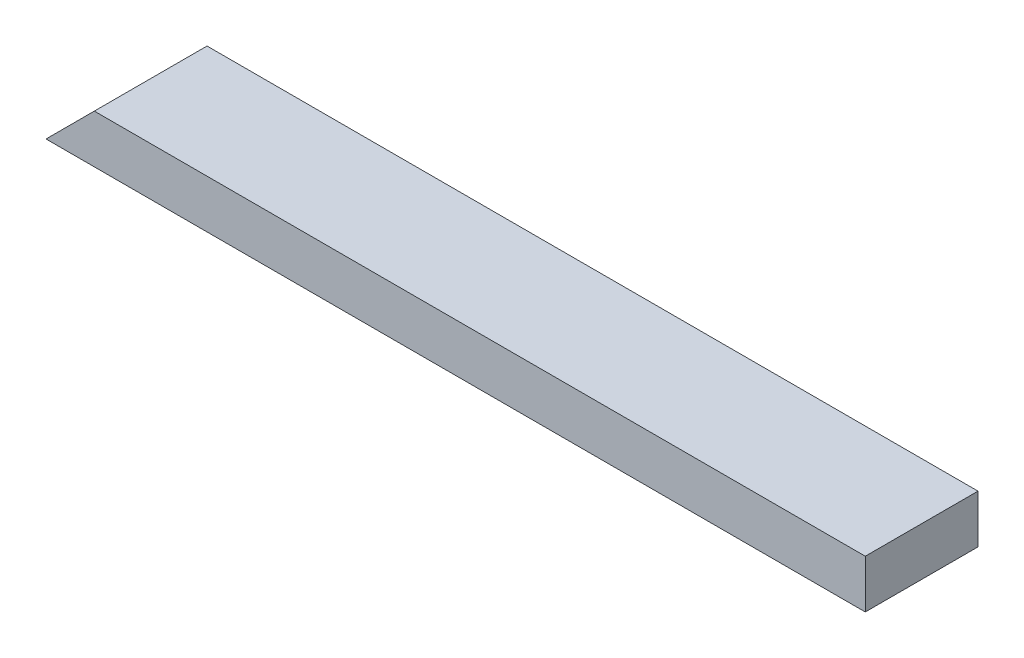
ISO-10303-21;
HEADER;
FILE_DESCRIPTION(('STEP AP214'),'2;1');
FILE_NAME('part.step','',(''),(''),'','','');
FILE_SCHEMA(('AUTOMOTIVE_DESIGN { 1 0 10303 214 1 1 1 1 }'));
ENDSEC;
DATA;
#1=APPLICATION_CONTEXT('core data for automotive mechanical design processes');
#2=APPLICATION_PROTOCOL_DEFINITION('international standard','automotive_design',2000,#1);
#3=PRODUCT_CONTEXT('',#1,'mechanical');
#4=PRODUCT('Part','Part','',(#3));
#5=PRODUCT_RELATED_PRODUCT_CATEGORY('part','',(#4));
#6=PRODUCT_DEFINITION_FORMATION('','',#4);
#7=PRODUCT_DEFINITION_CONTEXT('part definition',#1,'design');
#8=PRODUCT_DEFINITION('design','',#6,#7);
#9=PRODUCT_DEFINITION_SHAPE('','',#8);
#10=(LENGTH_UNIT() NAMED_UNIT(*) SI_UNIT(.MILLI.,.METRE.));
#11=(NAMED_UNIT(*) PLANE_ANGLE_UNIT() SI_UNIT($,.RADIAN.));
#12=(NAMED_UNIT(*) SI_UNIT($,.STERADIAN.) SOLID_ANGLE_UNIT());
#13=UNCERTAINTY_MEASURE_WITH_UNIT(LENGTH_MEASURE(1.E-05),#10,'distance_accuracy_value','');
#14=(GEOMETRIC_REPRESENTATION_CONTEXT(3) GLOBAL_UNCERTAINTY_ASSIGNED_CONTEXT((#13)) GLOBAL_UNIT_ASSIGNED_CONTEXT((#10,
#11,#12)) REPRESENTATION_CONTEXT('',''));
#15=CARTESIAN_POINT('',(0.,0.,0.));
#16=DIRECTION('',(0.,0.,1.));
#17=DIRECTION('',(1.,0.,0.));
#18=AXIS2_PLACEMENT_3D('',#15,#16,#17);
#19=CARTESIAN_POINT('',(0.,38.1,0.));
#20=DIRECTION('',(0.,0.,-1.));
#21=DIRECTION('',(-1.,0.,0.));
#22=AXIS2_PLACEMENT_3D('',#19,#20,#21);
#23=PLANE('',#22);
#24=DIRECTION('',(1.,0.,0.));
#25=VECTOR('',#24,1.);
#26=CARTESIAN_POINT('',(0.,38.1,0.));
#27=LINE('',#26,#25);
#28=CARTESIAN_POINT('',(38.1,38.1,0.));
#29=VERTEX_POINT('',#28);
#30=CARTESIAN_POINT('',(646.1125,38.1,0.));
#31=VERTEX_POINT('',#30);
#32=EDGE_CURVE('E97',#29,#31,#27,.T.);
#33=ORIENTED_EDGE('',*,*,#32,.F.);
#34=DIRECTION('',(0.707106781186547,0.707106781186547,0.));
#35=VECTOR('',#34,1.);
#36=CARTESIAN_POINT('',(0.,0.,0.));
#37=LINE('',#36,#35);
#38=CARTESIAN_POINT('',(0.,0.,0.));
#39=VERTEX_POINT('',#38);
#40=EDGE_CURVE('E90',#39,#29,#37,.T.);
#41=ORIENTED_EDGE('',*,*,#40,.F.);
#42=DIRECTION('',(1.,0.,0.));
#43=VECTOR('',#42,1.);
#44=CARTESIAN_POINT('',(0.,0.,0.));
#45=LINE('',#44,#43);
#46=CARTESIAN_POINT('',(646.1125,0.,0.));
#47=VERTEX_POINT('',#46);
#48=EDGE_CURVE('E101',#39,#47,#45,.T.);
#49=ORIENTED_EDGE('',*,*,#48,.T.);
#50=DIRECTION('',(0.,-1.,0.));
#51=VECTOR('',#50,1.);
#52=CARTESIAN_POINT('',(646.1125,38.1,0.));
#53=LINE('',#52,#51);
#54=EDGE_CURVE('E11',#31,#47,#53,.T.);
#55=ORIENTED_EDGE('',*,*,#54,.F.);
#56=EDGE_LOOP('',(#33,#41,#49,#55));
#57=FACE_BOUND('',#56,.T.);
#58=ADVANCED_FACE('F41',(#57),#23,.F.);
#59=CARTESIAN_POINT('',(646.1125,38.1,0.));
#60=DIRECTION('',(-1.,0.,0.));
#61=DIRECTION('',(0.,0.,1.));
#62=AXIS2_PLACEMENT_3D('',#59,#60,#61);
#63=PLANE('',#62);
#64=DIRECTION('',(0.,0.,-1.));
#65=VECTOR('',#64,1.);
#66=CARTESIAN_POINT('',(646.1125,0.,0.));
#67=LINE('',#66,#65);
#68=CARTESIAN_POINT('',(646.1125,0.,-88.9));
#69=VERTEX_POINT('',#68);
#70=EDGE_CURVE('E70',#47,#69,#67,.T.);
#71=ORIENTED_EDGE('',*,*,#70,.T.);
#72=DIRECTION('',(0.,-1.,0.));
#73=VECTOR('',#72,1.);
#74=CARTESIAN_POINT('',(646.1125,38.1,-88.9));
#75=LINE('',#74,#73);
#76=CARTESIAN_POINT('',(646.1125,38.1,-88.9));
#77=VERTEX_POINT('',#76);
#78=EDGE_CURVE('E50',#77,#69,#75,.T.);
#79=ORIENTED_EDGE('',*,*,#78,.F.);
#80=DIRECTION('',(0.,0.,-1.));
#81=VECTOR('',#80,1.);
#82=CARTESIAN_POINT('',(646.1125,38.1,0.));
#83=LINE('',#82,#81);
#84=EDGE_CURVE('E58',#31,#77,#83,.T.);
#85=ORIENTED_EDGE('',*,*,#84,.F.);
#86=ORIENTED_EDGE('',*,*,#54,.T.);
#87=EDGE_LOOP('',(#71,#79,#85,#86));
#88=FACE_BOUND('',#87,.T.);
#89=ADVANCED_FACE('F130',(#88),#63,.F.);
#90=CARTESIAN_POINT('',(0.,38.1,-88.9));
#91=DIRECTION('',(0.,0.,1.));
#92=DIRECTION('',(1.,0.,0.));
#93=AXIS2_PLACEMENT_3D('',#90,#91,#92);
#94=PLANE('',#93);
#95=DIRECTION('',(-1.,0.,0.));
#96=VECTOR('',#95,1.);
#97=CARTESIAN_POINT('',(0.,0.,-88.9));
#98=LINE('',#97,#96);
#99=CARTESIAN_POINT('',(0.,0.,-88.9));
#100=VERTEX_POINT('',#99);
#101=EDGE_CURVE('E93',#69,#100,#98,.T.);
#102=ORIENTED_EDGE('',*,*,#101,.T.);
#103=DIRECTION('',(0.707106781186547,0.707106781186547,0.));
#104=VECTOR('',#103,1.);
#105=CARTESIAN_POINT('',(0.,0.,-88.9));
#106=LINE('',#105,#104);
#107=CARTESIAN_POINT('',(38.1,38.1,-88.9));
#108=VERTEX_POINT('',#107);
#109=EDGE_CURVE('E77',#100,#108,#106,.T.);
#110=ORIENTED_EDGE('',*,*,#109,.T.);
#111=DIRECTION('',(-1.,0.,0.));
#112=VECTOR('',#111,1.);
#113=CARTESIAN_POINT('',(0.,38.1,-88.9));
#114=LINE('',#113,#112);
#115=EDGE_CURVE('E110',#77,#108,#114,.T.);
#116=ORIENTED_EDGE('',*,*,#115,.F.);
#117=ORIENTED_EDGE('',*,*,#78,.T.);
#118=EDGE_LOOP('',(#102,#110,#116,#117));
#119=FACE_BOUND('',#118,.T.);
#120=ADVANCED_FACE('F94',(#119),#94,.F.);
#121=CARTESIAN_POINT('',(0.,38.1,0.));
#122=DIRECTION('',(0.,-1.,0.));
#123=DIRECTION('',(0.,0.,-1.));
#124=AXIS2_PLACEMENT_3D('',#121,#122,#123);
#125=PLANE('',#124);
#126=ORIENTED_EDGE('',*,*,#115,.T.);
#127=DIRECTION('',(0.,0.,1.));
#128=VECTOR('',#127,1.);
#129=CARTESIAN_POINT('',(38.1,38.1,-88.9));
#130=LINE('',#129,#128);
#131=EDGE_CURVE('E86',#108,#29,#130,.T.);
#132=ORIENTED_EDGE('',*,*,#131,.T.);
#133=ORIENTED_EDGE('',*,*,#32,.T.);
#134=ORIENTED_EDGE('',*,*,#84,.T.);
#135=EDGE_LOOP('',(#126,#132,#133,#134));
#136=FACE_BOUND('',#135,.T.);
#137=ADVANCED_FACE('F128',(#136),#125,.F.);
#138=CARTESIAN_POINT('',(0.,0.,0.));
#139=DIRECTION('',(0.,-1.,0.));
#140=DIRECTION('',(0.,0.,-1.));
#141=AXIS2_PLACEMENT_3D('',#138,#139,#140);
#142=PLANE('',#141);
#143=DIRECTION('',(0.,0.,1.));
#144=VECTOR('',#143,1.);
#145=CARTESIAN_POINT('',(0.,0.,0.));
#146=LINE('',#145,#144);
#147=EDGE_CURVE('E83',#100,#39,#146,.T.);
#148=ORIENTED_EDGE('',*,*,#147,.F.);
#149=ORIENTED_EDGE('',*,*,#101,.F.);
#150=ORIENTED_EDGE('',*,*,#70,.F.);
#151=ORIENTED_EDGE('',*,*,#48,.F.);
#152=EDGE_LOOP('',(#148,#149,#150,#151));
#153=FACE_BOUND('',#152,.T.);
#154=ADVANCED_FACE('F100',(#153),#142,.T.);
#155=CARTESIAN_POINT('',(0.,0.,-88.9));
#156=DIRECTION('',(0.707106781186547,-0.707106781186547,0.));
#157=DIRECTION('',(0.707106781186548,0.707106781186548,0.));
#158=AXIS2_PLACEMENT_3D('',#155,#156,#157);
#159=PLANE('',#158);
#160=ORIENTED_EDGE('',*,*,#40,.T.);
#161=ORIENTED_EDGE('',*,*,#131,.F.);
#162=ORIENTED_EDGE('',*,*,#109,.F.);
#163=ORIENTED_EDGE('',*,*,#147,.T.);
#164=EDGE_LOOP('',(#160,#161,#162,#163));
#165=FACE_BOUND('',#164,.T.);
#166=ADVANCED_FACE('F80',(#165),#159,.F.);
#167=CLOSED_SHELL('',(#58,#89,#120,#137,#154,#166));
#168=MANIFOLD_SOLID_BREP('B2',#167);
#169=ADVANCED_BREP_SHAPE_REPRESENTATION('',(#18,#168),#14);
#170=SHAPE_DEFINITION_REPRESENTATION(#9,#169);
ENDSEC;
END-ISO-10303-21;
